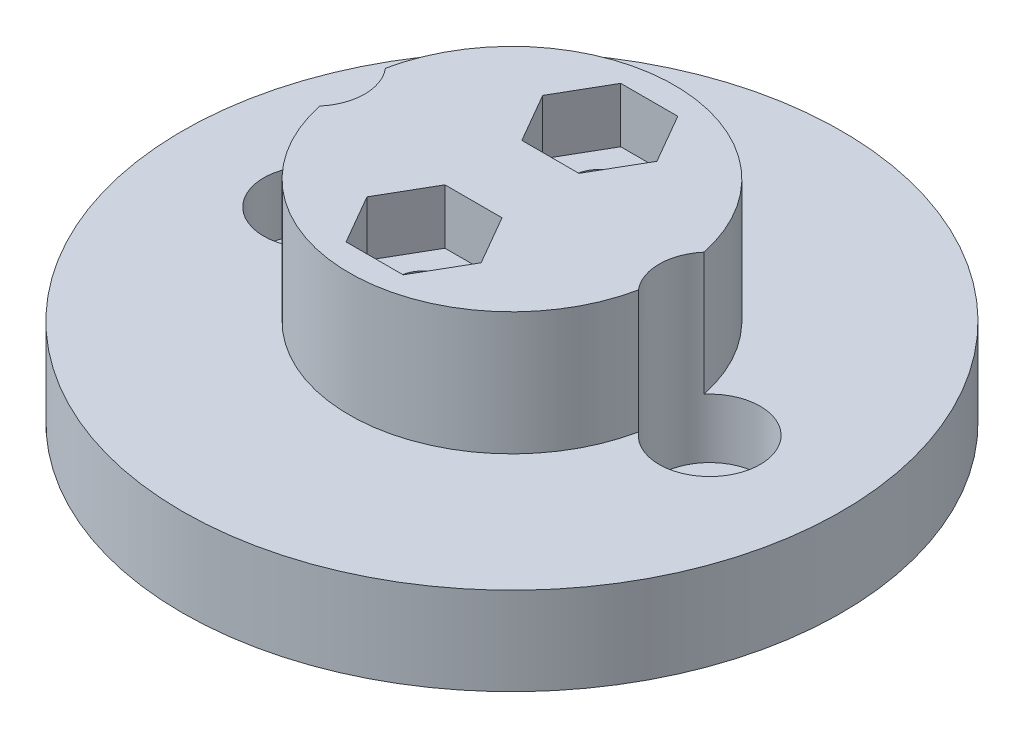
ISO-10303-21;
HEADER;
FILE_DESCRIPTION(('STEP AP214'),'2;1');
FILE_NAME('part.step','',(''),(''),'','','');
FILE_SCHEMA(('AUTOMOTIVE_DESIGN { 1 0 10303 214 1 1 1 1 }'));
ENDSEC;
DATA;
#1=APPLICATION_CONTEXT('core data for automotive mechanical design processes');
#2=APPLICATION_PROTOCOL_DEFINITION('international standard','automotive_design',2000,#1);
#3=PRODUCT_CONTEXT('',#1,'mechanical');
#4=PRODUCT('Part','Part','',(#3));
#5=PRODUCT_RELATED_PRODUCT_CATEGORY('part','',(#4));
#6=PRODUCT_DEFINITION_FORMATION('','',#4);
#7=PRODUCT_DEFINITION_CONTEXT('part definition',#1,'design');
#8=PRODUCT_DEFINITION('design','',#6,#7);
#9=PRODUCT_DEFINITION_SHAPE('','',#8);
#10=(LENGTH_UNIT() NAMED_UNIT(*) SI_UNIT(.MILLI.,.METRE.));
#11=(NAMED_UNIT(*) PLANE_ANGLE_UNIT() SI_UNIT($,.RADIAN.));
#12=(NAMED_UNIT(*) SI_UNIT($,.STERADIAN.) SOLID_ANGLE_UNIT());
#13=UNCERTAINTY_MEASURE_WITH_UNIT(LENGTH_MEASURE(1.E-05),#10,'distance_accuracy_value','');
#14=(GEOMETRIC_REPRESENTATION_CONTEXT(3) GLOBAL_UNCERTAINTY_ASSIGNED_CONTEXT((#13)) GLOBAL_UNIT_ASSIGNED_CONTEXT((#10,
#11,#12)) REPRESENTATION_CONTEXT('',''));
#15=CARTESIAN_POINT('',(0.,0.,0.));
#16=DIRECTION('',(0.,0.,1.));
#17=DIRECTION('',(1.,0.,0.));
#18=AXIS2_PLACEMENT_3D('',#15,#16,#17);
#19=CARTESIAN_POINT('',(0.,12.192,0.));
#20=DIRECTION('',(0.,-1.,0.));
#21=DIRECTION('',(0.,0.,-1.));
#22=AXIS2_PLACEMENT_3D('',#19,#20,#21);
#23=CYLINDRICAL_SURFACE('',#22,9.398);
#24=DIRECTION('',(0.,-1.,0.));
#25=VECTOR('',#24,1.);
#26=CARTESIAN_POINT('',(-9.20538333333333,6.9215,-1.89296637222876));
#27=LINE('',#26,#25);
#28=CARTESIAN_POINT('',(-9.20538333333333,12.192,-1.89296637222876));
#29=VERTEX_POINT('',#28);
#30=CARTESIAN_POINT('',(-9.20538333333333,5.08,-1.89296637222876));
#31=VERTEX_POINT('',#30);
#32=EDGE_CURVE('E281',#29,#31,#27,.T.);
#33=ORIENTED_EDGE('',*,*,#32,.F.);
#34=CARTESIAN_POINT('',(0.,12.192,0.));
#35=DIRECTION('',(0.,1.,0.));
#36=DIRECTION('',(0.,0.,1.));
#37=AXIS2_PLACEMENT_3D('',#34,#35,#36);
#38=CIRCLE('',#37,9.398);
#39=CARTESIAN_POINT('',(9.20538333333333,12.192,-1.89296637222876));
#40=VERTEX_POINT('',#39);
#41=EDGE_CURVE('E285',#40,#29,#38,.T.);
#42=ORIENTED_EDGE('',*,*,#41,.F.);
#43=DIRECTION('',(0.,-1.,0.));
#44=VECTOR('',#43,1.);
#45=CARTESIAN_POINT('',(9.20538333333333,6.9215,-1.89296637222876));
#46=LINE('',#45,#44);
#47=CARTESIAN_POINT('',(9.20538333333333,5.08,-1.89296637222876));
#48=VERTEX_POINT('',#47);
#49=EDGE_CURVE('E264',#48,#40,#46,.F.);
#50=ORIENTED_EDGE('',*,*,#49,.F.);
#51=CARTESIAN_POINT('',(0.,5.08,0.));
#52=DIRECTION('',(0.,1.,0.));
#53=DIRECTION('',(0.,0.,1.));
#54=AXIS2_PLACEMENT_3D('',#51,#52,#53);
#55=CIRCLE('',#54,9.398);
#56=EDGE_CURVE('E11',#48,#31,#55,.T.);
#57=ORIENTED_EDGE('',*,*,#56,.T.);
#58=EDGE_LOOP('',(#33,#42,#50,#57));
#59=FACE_BOUND('',#58,.T.);
#60=ADVANCED_FACE('F33',(#59),#23,.T.);
#61=DIRECTION('',(0.,-1.,0.));
#62=VECTOR('',#61,1.);
#63=CARTESIAN_POINT('',(-9.20538333333333,6.9215,1.89296637222876));
#64=LINE('',#63,#62);
#65=CARTESIAN_POINT('',(-9.20538333333333,5.08,1.89296637222876));
#66=VERTEX_POINT('',#65);
#67=CARTESIAN_POINT('',(-9.20538333333333,12.192,1.89296637222876));
#68=VERTEX_POINT('',#67);
#69=EDGE_CURVE('E276',#66,#68,#64,.F.);
#70=ORIENTED_EDGE('',*,*,#69,.F.);
#71=CARTESIAN_POINT('',(9.20538333333333,5.08,1.89296637222876));
#72=VERTEX_POINT('',#71);
#73=EDGE_CURVE('E42',#66,#72,#55,.T.);
#74=ORIENTED_EDGE('',*,*,#73,.T.);
#75=DIRECTION('',(0.,-1.,0.));
#76=VECTOR('',#75,1.);
#77=CARTESIAN_POINT('',(9.20538333333333,6.9215,1.89296637222876));
#78=LINE('',#77,#76);
#79=CARTESIAN_POINT('',(9.20538333333333,12.192,1.89296637222876));
#80=VERTEX_POINT('',#79);
#81=EDGE_CURVE('E274',#80,#72,#78,.T.);
#82=ORIENTED_EDGE('',*,*,#81,.F.);
#83=EDGE_CURVE('E283',#68,#80,#38,.T.);
#84=ORIENTED_EDGE('',*,*,#83,.F.);
#85=EDGE_LOOP('',(#70,#74,#82,#84));
#86=FACE_BOUND('',#85,.T.);
#87=ADVANCED_FACE('F325',(#86),#23,.T.);
#88=CARTESIAN_POINT('',(0.,5.08,0.));
#89=DIRECTION('',(0.,-1.,0.));
#90=DIRECTION('',(0.,0.,-1.));
#91=AXIS2_PLACEMENT_3D('',#88,#89,#90);
#92=CYLINDRICAL_SURFACE('',#91,19.05);
#93=CARTESIAN_POINT('',(0.,5.08,0.));
#94=DIRECTION('',(0.,1.,0.));
#95=DIRECTION('',(0.,0.,1.));
#96=AXIS2_PLACEMENT_3D('',#93,#94,#95);
#97=CIRCLE('',#96,19.05);
#98=CARTESIAN_POINT('',(0.,5.08,19.05));
#99=VERTEX_POINT('',#98);
#100=EDGE_CURVE('E288',#99,#99,#97,.T.);
#101=ORIENTED_EDGE('',*,*,#100,.F.);
#102=EDGE_LOOP('',(#101));
#103=FACE_BOUND('',#102,.T.);
#104=CARTESIAN_POINT('',(0.,0.,0.));
#105=DIRECTION('',(0.,1.,0.));
#106=DIRECTION('',(0.,0.,1.));
#107=AXIS2_PLACEMENT_3D('',#104,#105,#106);
#108=CIRCLE('',#107,19.05);
#109=CARTESIAN_POINT('',(0.,0.,19.05));
#110=VERTEX_POINT('',#109);
#111=EDGE_CURVE('E291',#110,#110,#108,.T.);
#112=ORIENTED_EDGE('',*,*,#111,.T.);
#113=EDGE_LOOP('',(#112));
#114=FACE_BOUND('',#113,.T.);
#115=ADVANCED_FACE('F35',(#103,#114),#92,.T.);
#116=CARTESIAN_POINT('',(0.,5.08,0.));
#117=DIRECTION('',(0.,1.,0.));
#118=DIRECTION('',(0.,0.,1.));
#119=AXIS2_PLACEMENT_3D('',#116,#117,#118);
#120=PLANE('',#119);
#121=ORIENTED_EDGE('',*,*,#73,.F.);
#122=CARTESIAN_POINT('',(-11.43,5.08,0.));
#123=DIRECTION('',(0.,1.,0.));
#124=DIRECTION('',(0.,0.,1.));
#125=AXIS2_PLACEMENT_3D('',#122,#123,#124);
#126=CIRCLE('',#125,2.921);
#127=EDGE_CURVE('E278',#66,#31,#126,.F.);
#128=ORIENTED_EDGE('',*,*,#127,.T.);
#129=ORIENTED_EDGE('',*,*,#56,.F.);
#130=CARTESIAN_POINT('',(11.43,5.08,0.));
#131=DIRECTION('',(0.,1.,0.));
#132=DIRECTION('',(0.,0.,1.));
#133=AXIS2_PLACEMENT_3D('',#130,#131,#132);
#134=CIRCLE('',#133,2.921);
#135=EDGE_CURVE('E271',#48,#72,#134,.F.);
#136=ORIENTED_EDGE('',*,*,#135,.T.);
#137=EDGE_LOOP('',(#121,#128,#129,#136));
#138=FACE_BOUND('',#137,.T.);
#139=ORIENTED_EDGE('',*,*,#100,.T.);
#140=EDGE_LOOP('',(#139));
#141=FACE_BOUND('',#140,.T.);
#142=ADVANCED_FACE('F337',(#138,#141),#120,.T.);
#143=CARTESIAN_POINT('',(0.,0.,0.));
#144=DIRECTION('',(0.,1.,0.));
#145=DIRECTION('',(0.,0.,1.));
#146=AXIS2_PLACEMENT_3D('',#143,#144,#145);
#147=PLANE('',#146);
#148=CARTESIAN_POINT('',(-11.43,0.,0.));
#149=DIRECTION('',(0.,1.,0.));
#150=DIRECTION('',(0.,0.,1.));
#151=AXIS2_PLACEMENT_3D('',#148,#149,#150);
#152=CIRCLE('',#151,1.4605);
#153=CARTESIAN_POINT('',(-11.43,0.,1.4605));
#154=VERTEX_POINT('',#153);
#155=EDGE_CURVE('E252',#154,#154,#152,.T.);
#156=ORIENTED_EDGE('',*,*,#155,.T.);
#157=EDGE_LOOP('',(#156));
#158=FACE_BOUND('',#157,.T.);
#159=CARTESIAN_POINT('',(11.43,0.,0.));
#160=DIRECTION('',(0.,1.,0.));
#161=DIRECTION('',(0.,0.,1.));
#162=AXIS2_PLACEMENT_3D('',#159,#160,#161);
#163=CIRCLE('',#162,1.73706235952143);
#164=CARTESIAN_POINT('',(11.43,0.,1.73706235952143));
#165=VERTEX_POINT('',#164);
#166=EDGE_CURVE('E199',#165,#165,#163,.T.);
#167=ORIENTED_EDGE('',*,*,#166,.T.);
#168=EDGE_LOOP('',(#167));
#169=FACE_BOUND('',#168,.T.);
#170=ORIENTED_EDGE('',*,*,#111,.F.);
#171=EDGE_LOOP('',(#170));
#172=FACE_BOUND('',#171,.T.);
#173=ADVANCED_FACE('F339',(#158,#169,#172),#147,.F.);
#174=CARTESIAN_POINT('',(0.,12.192,0.));
#175=DIRECTION('',(0.,1.,0.));
#176=DIRECTION('',(0.,0.,1.));
#177=AXIS2_PLACEMENT_3D('',#174,#175,#176);
#178=PLANE('',#177);
#179=DIRECTION('',(0.5,0.,-0.866025403784439));
#180=VECTOR('',#179,1.);
#181=CARTESIAN_POINT('',(1.64977839420936,12.192,-2.2225));
#182=LINE('',#181,#180);
#183=CARTESIAN_POINT('',(1.64977839420936,12.192,-2.2225));
#184=VERTEX_POINT('',#183);
#185=CARTESIAN_POINT('',(3.29955678841871,12.192,-5.08));
#186=VERTEX_POINT('',#185);
#187=EDGE_CURVE('E50',#184,#186,#182,.T.);
#188=ORIENTED_EDGE('',*,*,#187,.F.);
#189=DIRECTION('',(1.,0.,0.));
#190=VECTOR('',#189,1.);
#191=CARTESIAN_POINT('',(-1.64977839420936,12.192,-2.2225));
#192=LINE('',#191,#190);
#193=CARTESIAN_POINT('',(-1.64977839420936,12.192,-2.2225));
#194=VERTEX_POINT('',#193);
#195=EDGE_CURVE('E169',#194,#184,#192,.T.);
#196=ORIENTED_EDGE('',*,*,#195,.F.);
#197=DIRECTION('',(0.5,0.,0.866025403784439));
#198=VECTOR('',#197,1.);
#199=CARTESIAN_POINT('',(-3.29955678841871,12.192,-5.08));
#200=LINE('',#199,#198);
#201=CARTESIAN_POINT('',(-3.29955678841871,12.192,-5.08));
#202=VERTEX_POINT('',#201);
#203=EDGE_CURVE('E172',#202,#194,#200,.T.);
#204=ORIENTED_EDGE('',*,*,#203,.F.);
#205=DIRECTION('',(-0.5,0.,0.866025403784439));
#206=VECTOR('',#205,1.);
#207=CARTESIAN_POINT('',(-1.64977839420936,12.192,-7.9375));
#208=LINE('',#207,#206);
#209=CARTESIAN_POINT('',(-1.64977839420936,12.192,-7.9375));
#210=VERTEX_POINT('',#209);
#211=EDGE_CURVE('E192',#210,#202,#208,.T.);
#212=ORIENTED_EDGE('',*,*,#211,.F.);
#213=DIRECTION('',(-1.,0.,0.));
#214=VECTOR('',#213,1.);
#215=CARTESIAN_POINT('',(1.64977839420935,12.192,-7.9375));
#216=LINE('',#215,#214);
#217=CARTESIAN_POINT('',(1.64977839420935,12.192,-7.9375));
#218=VERTEX_POINT('',#217);
#219=EDGE_CURVE('E189',#218,#210,#216,.T.);
#220=ORIENTED_EDGE('',*,*,#219,.F.);
#221=DIRECTION('',(-0.5,0.,-0.866025403784439));
#222=VECTOR('',#221,1.);
#223=CARTESIAN_POINT('',(3.29955678841871,12.192,-5.08));
#224=LINE('',#223,#222);
#225=EDGE_CURVE('E186',#186,#218,#224,.T.);
#226=ORIENTED_EDGE('',*,*,#225,.F.);
#227=EDGE_LOOP('',(#188,#196,#204,#212,#220,#226));
#228=FACE_BOUND('',#227,.T.);
#229=DIRECTION('',(0.5,0.,-0.866025403784439));
#230=VECTOR('',#229,1.);
#231=CARTESIAN_POINT('',(1.64977839420935,12.192,7.9375));
#232=LINE('',#231,#230);
#233=CARTESIAN_POINT('',(1.64977839420935,12.192,7.9375));
#234=VERTEX_POINT('',#233);
#235=CARTESIAN_POINT('',(3.29955678841871,12.192,5.08));
#236=VERTEX_POINT('',#235);
#237=EDGE_CURVE('E58',#234,#236,#232,.T.);
#238=ORIENTED_EDGE('',*,*,#237,.F.);
#239=DIRECTION('',(1.,0.,0.));
#240=VECTOR('',#239,1.);
#241=CARTESIAN_POINT('',(-1.64977839420936,12.192,7.9375));
#242=LINE('',#241,#240);
#243=CARTESIAN_POINT('',(-1.64977839420936,12.192,7.9375));
#244=VERTEX_POINT('',#243);
#245=EDGE_CURVE('E211',#244,#234,#242,.T.);
#246=ORIENTED_EDGE('',*,*,#245,.F.);
#247=DIRECTION('',(0.5,0.,0.866025403784438));
#248=VECTOR('',#247,1.);
#249=CARTESIAN_POINT('',(-3.29955678841871,12.192,5.08));
#250=LINE('',#249,#248);
#251=CARTESIAN_POINT('',(-3.29955678841871,12.192,5.08));
#252=VERTEX_POINT('',#251);
#253=EDGE_CURVE('E237',#252,#244,#250,.T.);
#254=ORIENTED_EDGE('',*,*,#253,.F.);
#255=DIRECTION('',(-0.5,0.,0.866025403784439));
#256=VECTOR('',#255,1.);
#257=CARTESIAN_POINT('',(-1.64977839420936,12.192,2.2225));
#258=LINE('',#257,#256);
#259=CARTESIAN_POINT('',(-1.64977839420936,12.192,2.2225));
#260=VERTEX_POINT('',#259);
#261=EDGE_CURVE('E234',#260,#252,#258,.T.);
#262=ORIENTED_EDGE('',*,*,#261,.F.);
#263=DIRECTION('',(-1.,0.,0.));
#264=VECTOR('',#263,1.);
#265=CARTESIAN_POINT('',(1.64977839420935,12.192,2.2225));
#266=LINE('',#265,#264);
#267=CARTESIAN_POINT('',(1.64977839420935,12.192,2.2225));
#268=VERTEX_POINT('',#267);
#269=EDGE_CURVE('E231',#268,#260,#266,.T.);
#270=ORIENTED_EDGE('',*,*,#269,.F.);
#271=DIRECTION('',(-0.5,0.,-0.866025403784439));
#272=VECTOR('',#271,1.);
#273=CARTESIAN_POINT('',(3.29955678841871,12.192,5.08));
#274=LINE('',#273,#272);
#275=EDGE_CURVE('E228',#236,#268,#274,.T.);
#276=ORIENTED_EDGE('',*,*,#275,.F.);
#277=EDGE_LOOP('',(#238,#246,#254,#262,#270,#276));
#278=FACE_BOUND('',#277,.T.);
#279=ORIENTED_EDGE('',*,*,#41,.T.);
#280=CARTESIAN_POINT('',(-11.43,12.192,0.));
#281=DIRECTION('',(0.,1.,0.));
#282=DIRECTION('',(0.,0.,1.));
#283=AXIS2_PLACEMENT_3D('',#280,#281,#282);
#284=CIRCLE('',#283,2.921);
#285=EDGE_CURVE('E261',#68,#29,#284,.T.);
#286=ORIENTED_EDGE('',*,*,#285,.F.);
#287=ORIENTED_EDGE('',*,*,#83,.T.);
#288=CARTESIAN_POINT('',(11.43,12.192,0.));
#289=DIRECTION('',(0.,1.,0.));
#290=DIRECTION('',(0.,0.,1.));
#291=AXIS2_PLACEMENT_3D('',#288,#289,#290);
#292=CIRCLE('',#291,2.921);
#293=EDGE_CURVE('E262',#40,#80,#292,.T.);
#294=ORIENTED_EDGE('',*,*,#293,.F.);
#295=EDGE_LOOP('',(#279,#286,#287,#294));
#296=FACE_BOUND('',#295,.T.);
#297=ADVANCED_FACE('F335',(#228,#278,#296),#178,.T.);
#298=CARTESIAN_POINT('',(11.43,12.192,0.));
#299=DIRECTION('',(0.,-1.,0.));
#300=DIRECTION('',(0.,0.,-1.));
#301=AXIS2_PLACEMENT_3D('',#298,#299,#300);
#302=CYLINDRICAL_SURFACE('',#301,2.921);
#303=CARTESIAN_POINT('',(11.43,1.651,0.));
#304=DIRECTION('',(0.,1.,0.));
#305=DIRECTION('',(0.,0.,1.));
#306=AXIS2_PLACEMENT_3D('',#303,#304,#305);
#307=CIRCLE('',#306,2.921);
#308=CARTESIAN_POINT('',(11.43,1.651,2.921));
#309=VERTEX_POINT('',#308);
#310=EDGE_CURVE('E265',#309,#309,#307,.T.);
#311=ORIENTED_EDGE('',*,*,#310,.F.);
#312=EDGE_LOOP('',(#311));
#313=FACE_BOUND('',#312,.T.);
#314=ORIENTED_EDGE('',*,*,#81,.T.);
#315=ORIENTED_EDGE('',*,*,#135,.F.);
#316=ORIENTED_EDGE('',*,*,#49,.T.);
#317=ORIENTED_EDGE('',*,*,#293,.T.);
#318=EDGE_LOOP('',(#314,#315,#316,#317));
#319=FACE_BOUND('',#318,.T.);
#320=ADVANCED_FACE('F346',(#313,#319),#302,.F.);
#321=CARTESIAN_POINT('',(11.43,1.651,0.));
#322=DIRECTION('',(0.,1.,0.));
#323=DIRECTION('',(0.,0.,1.));
#324=AXIS2_PLACEMENT_3D('',#321,#322,#323);
#325=PLANE('',#324);
#326=CARTESIAN_POINT('',(11.43,1.651,0.));
#327=DIRECTION('',(0.,1.,0.));
#328=DIRECTION('',(0.,0.,1.));
#329=AXIS2_PLACEMENT_3D('',#326,#327,#328);
#330=CIRCLE('',#329,1.73706235952143);
#331=CARTESIAN_POINT('',(11.43,1.651,1.73706235952143));
#332=VERTEX_POINT('',#331);
#333=EDGE_CURVE('E268',#332,#332,#330,.T.);
#334=ORIENTED_EDGE('',*,*,#333,.F.);
#335=EDGE_LOOP('',(#334));
#336=FACE_BOUND('',#335,.T.);
#337=ORIENTED_EDGE('',*,*,#310,.T.);
#338=EDGE_LOOP('',(#337));
#339=FACE_BOUND('',#338,.T.);
#340=ADVANCED_FACE('F378',(#336,#339),#325,.T.);
#341=CARTESIAN_POINT('',(-11.43,12.192,0.));
#342=DIRECTION('',(0.,-1.,0.));
#343=DIRECTION('',(0.,0.,-1.));
#344=AXIS2_PLACEMENT_3D('',#341,#342,#343);
#345=CYLINDRICAL_SURFACE('',#344,2.921);
#346=CARTESIAN_POINT('',(-11.43,1.651,0.));
#347=DIRECTION('',(0.,1.,0.));
#348=DIRECTION('',(0.,0.,1.));
#349=AXIS2_PLACEMENT_3D('',#346,#347,#348);
#350=CIRCLE('',#349,2.921);
#351=CARTESIAN_POINT('',(-11.43,1.651,2.921));
#352=VERTEX_POINT('',#351);
#353=EDGE_CURVE('E258',#352,#352,#350,.T.);
#354=ORIENTED_EDGE('',*,*,#353,.F.);
#355=EDGE_LOOP('',(#354));
#356=FACE_BOUND('',#355,.T.);
#357=ORIENTED_EDGE('',*,*,#32,.T.);
#358=ORIENTED_EDGE('',*,*,#127,.F.);
#359=ORIENTED_EDGE('',*,*,#69,.T.);
#360=ORIENTED_EDGE('',*,*,#285,.T.);
#361=EDGE_LOOP('',(#357,#358,#359,#360));
#362=FACE_BOUND('',#361,.T.);
#363=ADVANCED_FACE('F386',(#356,#362),#345,.F.);
#364=CARTESIAN_POINT('',(-11.43,1.651,0.));
#365=DIRECTION('',(0.,1.,0.));
#366=DIRECTION('',(0.,0.,1.));
#367=AXIS2_PLACEMENT_3D('',#364,#365,#366);
#368=PLANE('',#367);
#369=CARTESIAN_POINT('',(-11.43,1.651,0.));
#370=DIRECTION('',(0.,1.,0.));
#371=DIRECTION('',(0.,0.,1.));
#372=AXIS2_PLACEMENT_3D('',#369,#370,#371);
#373=CIRCLE('',#372,1.4605);
#374=CARTESIAN_POINT('',(-11.43,1.651,1.4605));
#375=VERTEX_POINT('',#374);
#376=EDGE_CURVE('E255',#375,#375,#373,.T.);
#377=ORIENTED_EDGE('',*,*,#376,.F.);
#378=EDGE_LOOP('',(#377));
#379=FACE_BOUND('',#378,.T.);
#380=ORIENTED_EDGE('',*,*,#353,.T.);
#381=EDGE_LOOP('',(#380));
#382=FACE_BOUND('',#381,.T.);
#383=ADVANCED_FACE('F390',(#379,#382),#368,.T.);
#384=CARTESIAN_POINT('',(-11.43,0.,0.));
#385=DIRECTION('',(0.,1.,0.));
#386=DIRECTION('',(0.,0.,1.));
#387=AXIS2_PLACEMENT_3D('',#384,#385,#386);
#388=CYLINDRICAL_SURFACE('',#387,1.4605);
#389=ORIENTED_EDGE('',*,*,#376,.T.);
#390=EDGE_LOOP('',(#389));
#391=FACE_BOUND('',#390,.T.);
#392=ORIENTED_EDGE('',*,*,#155,.F.);
#393=EDGE_LOOP('',(#392));
#394=FACE_BOUND('',#393,.T.);
#395=ADVANCED_FACE('F412',(#391,#394),#388,.F.);
#396=CARTESIAN_POINT('',(11.43,0.,0.));
#397=DIRECTION('',(0.,1.,0.));
#398=DIRECTION('',(0.,0.,1.));
#399=AXIS2_PLACEMENT_3D('',#396,#397,#398);
#400=CYLINDRICAL_SURFACE('',#399,1.73706235952143);
#401=ORIENTED_EDGE('',*,*,#333,.T.);
#402=EDGE_LOOP('',(#401));
#403=FACE_BOUND('',#402,.T.);
#404=ORIENTED_EDGE('',*,*,#166,.F.);
#405=EDGE_LOOP('',(#404));
#406=FACE_BOUND('',#405,.T.);
#407=ADVANCED_FACE('F422',(#403,#406),#400,.F.);
#408=CARTESIAN_POINT('',(1.64977839420935,9.017,7.9375));
#409=DIRECTION('',(0.866025403784439,0.,0.5));
#410=DIRECTION('',(0.5,0.,-0.866025403784439));
#411=AXIS2_PLACEMENT_3D('',#408,#409,#410);
#412=PLANE('',#411);
#413=ORIENTED_EDGE('',*,*,#237,.T.);
#414=DIRECTION('',(0.,1.,0.));
#415=VECTOR('',#414,1.);
#416=CARTESIAN_POINT('',(3.29955678841871,9.017,5.08));
#417=LINE('',#416,#415);
#418=CARTESIAN_POINT('',(3.29955678841871,9.017,5.08));
#419=VERTEX_POINT('',#418);
#420=EDGE_CURVE('E226',#419,#236,#417,.T.);
#421=ORIENTED_EDGE('',*,*,#420,.F.);
#422=DIRECTION('',(0.5,0.,-0.866025403784439));
#423=VECTOR('',#422,1.);
#424=CARTESIAN_POINT('',(1.64977839420935,9.017,7.9375));
#425=LINE('',#424,#423);
#426=CARTESIAN_POINT('',(1.64977839420935,9.017,7.9375));
#427=VERTEX_POINT('',#426);
#428=EDGE_CURVE('E207',#427,#419,#425,.T.);
#429=ORIENTED_EDGE('',*,*,#428,.F.);
#430=DIRECTION('',(0.,1.,0.));
#431=VECTOR('',#430,1.);
#432=CARTESIAN_POINT('',(1.64977839420935,9.017,7.9375));
#433=LINE('',#432,#431);
#434=EDGE_CURVE('E187',#427,#234,#433,.T.);
#435=ORIENTED_EDGE('',*,*,#434,.T.);
#436=EDGE_LOOP('',(#413,#421,#429,#435));
#437=FACE_BOUND('',#436,.T.);
#438=ADVANCED_FACE('F432',(#437),#412,.F.);
#439=CARTESIAN_POINT('',(-1.64977839420936,9.017,7.9375));
#440=DIRECTION('',(0.,0.,1.));
#441=DIRECTION('',(1.,0.,0.));
#442=AXIS2_PLACEMENT_3D('',#439,#440,#441);
#443=PLANE('',#442);
#444=ORIENTED_EDGE('',*,*,#245,.T.);
#445=ORIENTED_EDGE('',*,*,#434,.F.);
#446=DIRECTION('',(1.,0.,0.));
#447=VECTOR('',#446,1.);
#448=CARTESIAN_POINT('',(-1.64977839420936,9.017,7.9375));
#449=LINE('',#448,#447);
#450=CARTESIAN_POINT('',(-1.64977839420936,9.017,7.9375));
#451=VERTEX_POINT('',#450);
#452=EDGE_CURVE('E223',#451,#427,#449,.T.);
#453=ORIENTED_EDGE('',*,*,#452,.F.);
#454=DIRECTION('',(0.,1.,0.));
#455=VECTOR('',#454,1.);
#456=CARTESIAN_POINT('',(-1.64977839420936,9.017,7.9375));
#457=LINE('',#456,#455);
#458=EDGE_CURVE('E243',#451,#244,#457,.T.);
#459=ORIENTED_EDGE('',*,*,#458,.T.);
#460=EDGE_LOOP('',(#444,#445,#453,#459));
#461=FACE_BOUND('',#460,.T.);
#462=ADVANCED_FACE('F447',(#461),#443,.F.);
#463=CARTESIAN_POINT('',(-3.29955678841871,9.017,5.08));
#464=DIRECTION('',(-0.866025403784438,0.,0.5));
#465=DIRECTION('',(0.5,0.,0.866025403784439));
#466=AXIS2_PLACEMENT_3D('',#463,#464,#465);
#467=PLANE('',#466);
#468=ORIENTED_EDGE('',*,*,#253,.T.);
#469=ORIENTED_EDGE('',*,*,#458,.F.);
#470=DIRECTION('',(0.5,0.,0.866025403784438));
#471=VECTOR('',#470,1.);
#472=CARTESIAN_POINT('',(-3.29955678841871,9.017,5.08));
#473=LINE('',#472,#471);
#474=CARTESIAN_POINT('',(-3.29955678841871,9.017,5.08));
#475=VERTEX_POINT('',#474);
#476=EDGE_CURVE('E220',#475,#451,#473,.T.);
#477=ORIENTED_EDGE('',*,*,#476,.F.);
#478=DIRECTION('',(0.,1.,0.));
#479=VECTOR('',#478,1.);
#480=CARTESIAN_POINT('',(-3.29955678841871,9.017,5.08));
#481=LINE('',#480,#479);
#482=EDGE_CURVE('E245',#475,#252,#481,.T.);
#483=ORIENTED_EDGE('',*,*,#482,.T.);
#484=EDGE_LOOP('',(#468,#469,#477,#483));
#485=FACE_BOUND('',#484,.T.);
#486=ADVANCED_FACE('F456',(#485),#467,.F.);
#487=CARTESIAN_POINT('',(-1.64977839420936,9.017,2.2225));
#488=DIRECTION('',(-0.866025403784439,0.,-0.5));
#489=DIRECTION('',(-0.5,0.,0.866025403784439));
#490=AXIS2_PLACEMENT_3D('',#487,#488,#489);
#491=PLANE('',#490);
#492=ORIENTED_EDGE('',*,*,#261,.T.);
#493=ORIENTED_EDGE('',*,*,#482,.F.);
#494=DIRECTION('',(-0.5,0.,0.866025403784439));
#495=VECTOR('',#494,1.);
#496=CARTESIAN_POINT('',(-1.64977839420936,9.017,2.2225));
#497=LINE('',#496,#495);
#498=CARTESIAN_POINT('',(-1.64977839420936,9.017,2.2225));
#499=VERTEX_POINT('',#498);
#500=EDGE_CURVE('E217',#499,#475,#497,.T.);
#501=ORIENTED_EDGE('',*,*,#500,.F.);
#502=DIRECTION('',(0.,1.,0.));
#503=VECTOR('',#502,1.);
#504=CARTESIAN_POINT('',(-1.64977839420936,9.017,2.2225));
#505=LINE('',#504,#503);
#506=EDGE_CURVE('E247',#499,#260,#505,.T.);
#507=ORIENTED_EDGE('',*,*,#506,.T.);
#508=EDGE_LOOP('',(#492,#493,#501,#507));
#509=FACE_BOUND('',#508,.T.);
#510=ADVANCED_FACE('F466',(#509),#491,.F.);
#511=CARTESIAN_POINT('',(1.64977839420935,9.017,2.2225));
#512=DIRECTION('',(0.,0.,-1.));
#513=DIRECTION('',(-1.,0.,0.));
#514=AXIS2_PLACEMENT_3D('',#511,#512,#513);
#515=PLANE('',#514);
#516=ORIENTED_EDGE('',*,*,#269,.T.);
#517=ORIENTED_EDGE('',*,*,#506,.F.);
#518=DIRECTION('',(-1.,0.,0.));
#519=VECTOR('',#518,1.);
#520=CARTESIAN_POINT('',(1.64977839420935,9.017,2.2225));
#521=LINE('',#520,#519);
#522=CARTESIAN_POINT('',(1.64977839420935,9.017,2.2225));
#523=VERTEX_POINT('',#522);
#524=EDGE_CURVE('E214',#523,#499,#521,.T.);
#525=ORIENTED_EDGE('',*,*,#524,.F.);
#526=DIRECTION('',(0.,1.,0.));
#527=VECTOR('',#526,1.);
#528=CARTESIAN_POINT('',(1.64977839420935,9.017,2.2225));
#529=LINE('',#528,#527);
#530=EDGE_CURVE('E249',#523,#268,#529,.T.);
#531=ORIENTED_EDGE('',*,*,#530,.T.);
#532=EDGE_LOOP('',(#516,#517,#525,#531));
#533=FACE_BOUND('',#532,.T.);
#534=ADVANCED_FACE('F476',(#533),#515,.F.);
#535=CARTESIAN_POINT('',(3.29955678841871,9.017,5.08));
#536=DIRECTION('',(0.866025403784439,0.,-0.5));
#537=DIRECTION('',(-0.5,0.,-0.866025403784439));
#538=AXIS2_PLACEMENT_3D('',#535,#536,#537);
#539=PLANE('',#538);
#540=ORIENTED_EDGE('',*,*,#275,.T.);
#541=ORIENTED_EDGE('',*,*,#530,.F.);
#542=DIRECTION('',(-0.5,0.,-0.866025403784439));
#543=VECTOR('',#542,1.);
#544=CARTESIAN_POINT('',(3.29955678841871,9.017,5.08));
#545=LINE('',#544,#543);
#546=EDGE_CURVE('E210',#419,#523,#545,.T.);
#547=ORIENTED_EDGE('',*,*,#546,.F.);
#548=ORIENTED_EDGE('',*,*,#420,.T.);
#549=EDGE_LOOP('',(#540,#541,#547,#548));
#550=FACE_BOUND('',#549,.T.);
#551=ADVANCED_FACE('F486',(#550),#539,.F.);
#552=CARTESIAN_POINT('',(0.,9.017,0.));
#553=DIRECTION('',(0.,1.,0.));
#554=DIRECTION('',(0.,0.,1.));
#555=AXIS2_PLACEMENT_3D('',#552,#553,#554);
#556=PLANE('',#555);
#557=CARTESIAN_POINT('',(0.,9.017,5.08));
#558=DIRECTION('',(0.,1.,0.));
#559=DIRECTION('',(0.,0.,1.));
#560=AXIS2_PLACEMENT_3D('',#557,#558,#559);
#561=CIRCLE('',#560,1.5875);
#562=CARTESIAN_POINT('',(0.,9.017,6.6675));
#563=VERTEX_POINT('',#562);
#564=EDGE_CURVE('E37',#563,#563,#561,.T.);
#565=ORIENTED_EDGE('',*,*,#564,.F.);
#566=EDGE_LOOP('',(#565));
#567=FACE_BOUND('',#566,.T.);
#568=ORIENTED_EDGE('',*,*,#428,.T.);
#569=ORIENTED_EDGE('',*,*,#546,.T.);
#570=ORIENTED_EDGE('',*,*,#524,.T.);
#571=ORIENTED_EDGE('',*,*,#500,.T.);
#572=ORIENTED_EDGE('',*,*,#476,.T.);
#573=ORIENTED_EDGE('',*,*,#452,.T.);
#574=EDGE_LOOP('',(#568,#569,#570,#571,#572,#573));
#575=FACE_BOUND('',#574,.T.);
#576=ADVANCED_FACE('F496',(#567,#575),#556,.T.);
#577=CARTESIAN_POINT('',(1.64977839420936,9.017,-2.2225));
#578=DIRECTION('',(0.866025403784439,0.,0.5));
#579=DIRECTION('',(0.5,0.,-0.866025403784439));
#580=AXIS2_PLACEMENT_3D('',#577,#578,#579);
#581=PLANE('',#580);
#582=ORIENTED_EDGE('',*,*,#187,.T.);
#583=DIRECTION('',(0.,1.,0.));
#584=VECTOR('',#583,1.);
#585=CARTESIAN_POINT('',(3.29955678841871,9.017,-5.08));
#586=LINE('',#585,#584);
#587=CARTESIAN_POINT('',(3.29955678841871,9.017,-5.08));
#588=VERTEX_POINT('',#587);
#589=EDGE_CURVE('E146',#588,#186,#586,.T.);
#590=ORIENTED_EDGE('',*,*,#589,.F.);
#591=DIRECTION('',(0.5,0.,-0.866025403784439));
#592=VECTOR('',#591,1.);
#593=CARTESIAN_POINT('',(1.64977839420936,9.017,-2.2225));
#594=LINE('',#593,#592);
#595=CARTESIAN_POINT('',(1.64977839420936,9.017,-2.2225));
#596=VERTEX_POINT('',#595);
#597=EDGE_CURVE('E150',#596,#588,#594,.T.);
#598=ORIENTED_EDGE('',*,*,#597,.F.);
#599=DIRECTION('',(0.,1.,0.));
#600=VECTOR('',#599,1.);
#601=CARTESIAN_POINT('',(1.64977839420936,9.017,-2.2225));
#602=LINE('',#601,#600);
#603=EDGE_CURVE('E197',#596,#184,#602,.T.);
#604=ORIENTED_EDGE('',*,*,#603,.T.);
#605=EDGE_LOOP('',(#582,#590,#598,#604));
#606=FACE_BOUND('',#605,.T.);
#607=ADVANCED_FACE('F148',(#606),#581,.F.);
#608=CARTESIAN_POINT('',(-1.64977839420936,9.017,-2.2225));
#609=DIRECTION('',(0.,0.,1.));
#610=DIRECTION('',(1.,0.,0.));
#611=AXIS2_PLACEMENT_3D('',#608,#609,#610);
#612=PLANE('',#611);
#613=ORIENTED_EDGE('',*,*,#195,.T.);
#614=ORIENTED_EDGE('',*,*,#603,.F.);
#615=DIRECTION('',(1.,0.,0.));
#616=VECTOR('',#615,1.);
#617=CARTESIAN_POINT('',(-1.64977839420936,9.017,-2.2225));
#618=LINE('',#617,#616);
#619=CARTESIAN_POINT('',(-1.64977839420936,9.017,-2.2225));
#620=VERTEX_POINT('',#619);
#621=EDGE_CURVE('E156',#620,#596,#618,.T.);
#622=ORIENTED_EDGE('',*,*,#621,.F.);
#623=DIRECTION('',(0.,1.,0.));
#624=VECTOR('',#623,1.);
#625=CARTESIAN_POINT('',(-1.64977839420936,9.017,-2.2225));
#626=LINE('',#625,#624);
#627=EDGE_CURVE('E200',#620,#194,#626,.T.);
#628=ORIENTED_EDGE('',*,*,#627,.T.);
#629=EDGE_LOOP('',(#613,#614,#622,#628));
#630=FACE_BOUND('',#629,.T.);
#631=ADVANCED_FACE('F508',(#630),#612,.F.);
#632=CARTESIAN_POINT('',(-3.29955678841871,9.017,-5.08));
#633=DIRECTION('',(-0.866025403784439,0.,0.5));
#634=DIRECTION('',(0.5,0.,0.866025403784439));
#635=AXIS2_PLACEMENT_3D('',#632,#633,#634);
#636=PLANE('',#635);
#637=ORIENTED_EDGE('',*,*,#203,.T.);
#638=ORIENTED_EDGE('',*,*,#627,.F.);
#639=DIRECTION('',(0.5,0.,0.866025403784439));
#640=VECTOR('',#639,1.);
#641=CARTESIAN_POINT('',(-3.29955678841871,9.017,-5.08));
#642=LINE('',#641,#640);
#643=CARTESIAN_POINT('',(-3.29955678841871,9.017,-5.08));
#644=VERTEX_POINT('',#643);
#645=EDGE_CURVE('E182',#644,#620,#642,.T.);
#646=ORIENTED_EDGE('',*,*,#645,.F.);
#647=DIRECTION('',(0.,1.,0.));
#648=VECTOR('',#647,1.);
#649=CARTESIAN_POINT('',(-3.29955678841871,9.017,-5.08));
#650=LINE('',#649,#648);
#651=EDGE_CURVE('E202',#644,#202,#650,.T.);
#652=ORIENTED_EDGE('',*,*,#651,.T.);
#653=EDGE_LOOP('',(#637,#638,#646,#652));
#654=FACE_BOUND('',#653,.T.);
#655=ADVANCED_FACE('F517',(#654),#636,.F.);
#656=CARTESIAN_POINT('',(-1.64977839420936,9.017,-7.9375));
#657=DIRECTION('',(-0.866025403784439,0.,-0.5));
#658=DIRECTION('',(-0.5,0.,0.866025403784439));
#659=AXIS2_PLACEMENT_3D('',#656,#657,#658);
#660=PLANE('',#659);
#661=ORIENTED_EDGE('',*,*,#211,.T.);
#662=ORIENTED_EDGE('',*,*,#651,.F.);
#663=DIRECTION('',(-0.5,0.,0.866025403784439));
#664=VECTOR('',#663,1.);
#665=CARTESIAN_POINT('',(-1.64977839420936,9.017,-7.9375));
#666=LINE('',#665,#664);
#667=CARTESIAN_POINT('',(-1.64977839420936,9.017,-7.9375));
#668=VERTEX_POINT('',#667);
#669=EDGE_CURVE('E179',#668,#644,#666,.T.);
#670=ORIENTED_EDGE('',*,*,#669,.F.);
#671=DIRECTION('',(0.,1.,0.));
#672=VECTOR('',#671,1.);
#673=CARTESIAN_POINT('',(-1.64977839420936,9.017,-7.9375));
#674=LINE('',#673,#672);
#675=EDGE_CURVE('E204',#668,#210,#674,.T.);
#676=ORIENTED_EDGE('',*,*,#675,.T.);
#677=EDGE_LOOP('',(#661,#662,#670,#676));
#678=FACE_BOUND('',#677,.T.);
#679=ADVANCED_FACE('F527',(#678),#660,.F.);
#680=CARTESIAN_POINT('',(1.64977839420935,9.017,-7.9375));
#681=DIRECTION('',(0.,0.,-1.));
#682=DIRECTION('',(-1.,0.,0.));
#683=AXIS2_PLACEMENT_3D('',#680,#681,#682);
#684=PLANE('',#683);
#685=ORIENTED_EDGE('',*,*,#219,.T.);
#686=ORIENTED_EDGE('',*,*,#675,.F.);
#687=DIRECTION('',(-1.,0.,0.));
#688=VECTOR('',#687,1.);
#689=CARTESIAN_POINT('',(1.64977839420935,9.017,-7.9375));
#690=LINE('',#689,#688);
#691=CARTESIAN_POINT('',(1.64977839420935,9.017,-7.9375));
#692=VERTEX_POINT('',#691);
#693=EDGE_CURVE('E164',#692,#668,#690,.T.);
#694=ORIENTED_EDGE('',*,*,#693,.F.);
#695=DIRECTION('',(0.,1.,0.));
#696=VECTOR('',#695,1.);
#697=CARTESIAN_POINT('',(1.64977839420935,9.017,-7.9375));
#698=LINE('',#697,#696);
#699=EDGE_CURVE('E155',#692,#218,#698,.T.);
#700=ORIENTED_EDGE('',*,*,#699,.T.);
#701=EDGE_LOOP('',(#685,#686,#694,#700));
#702=FACE_BOUND('',#701,.T.);
#703=ADVANCED_FACE('F537',(#702),#684,.F.);
#704=CARTESIAN_POINT('',(3.29955678841871,9.017,-5.08));
#705=DIRECTION('',(0.866025403784439,0.,-0.5));
#706=DIRECTION('',(-0.5,0.,-0.866025403784439));
#707=AXIS2_PLACEMENT_3D('',#704,#705,#706);
#708=PLANE('',#707);
#709=ORIENTED_EDGE('',*,*,#225,.T.);
#710=ORIENTED_EDGE('',*,*,#699,.F.);
#711=DIRECTION('',(-0.5,0.,-0.866025403784439));
#712=VECTOR('',#711,1.);
#713=CARTESIAN_POINT('',(3.29955678841871,9.017,-5.08));
#714=LINE('',#713,#712);
#715=EDGE_CURVE('E159',#588,#692,#714,.T.);
#716=ORIENTED_EDGE('',*,*,#715,.F.);
#717=ORIENTED_EDGE('',*,*,#589,.T.);
#718=EDGE_LOOP('',(#709,#710,#716,#717));
#719=FACE_BOUND('',#718,.T.);
#720=ADVANCED_FACE('F160',(#719),#708,.F.);
#721=CARTESIAN_POINT('',(0.,9.017,0.));
#722=DIRECTION('',(0.,1.,0.));
#723=DIRECTION('',(0.,0.,1.));
#724=AXIS2_PLACEMENT_3D('',#721,#722,#723);
#725=PLANE('',#724);
#726=CARTESIAN_POINT('',(0.,9.017,-5.08));
#727=DIRECTION('',(0.,1.,0.));
#728=DIRECTION('',(0.,0.,1.));
#729=AXIS2_PLACEMENT_3D('',#726,#727,#728);
#730=CIRCLE('',#729,1.5875);
#731=CARTESIAN_POINT('',(0.,9.017,-3.4925));
#732=VERTEX_POINT('',#731);
#733=EDGE_CURVE('E297',#732,#732,#730,.T.);
#734=ORIENTED_EDGE('',*,*,#733,.F.);
#735=EDGE_LOOP('',(#734));
#736=FACE_BOUND('',#735,.T.);
#737=ORIENTED_EDGE('',*,*,#597,.T.);
#738=ORIENTED_EDGE('',*,*,#715,.T.);
#739=ORIENTED_EDGE('',*,*,#693,.T.);
#740=ORIENTED_EDGE('',*,*,#669,.T.);
#741=ORIENTED_EDGE('',*,*,#645,.T.);
#742=ORIENTED_EDGE('',*,*,#621,.T.);
#743=EDGE_LOOP('',(#737,#738,#739,#740,#741,#742));
#744=FACE_BOUND('',#743,.T.);
#745=ADVANCED_FACE('F166',(#736,#744),#725,.T.);
#746=CARTESIAN_POINT('',(0.,4.572,-5.08));
#747=DIRECTION('',(0.,1.,0.));
#748=DIRECTION('',(0.,0.,1.));
#749=AXIS2_PLACEMENT_3D('',#746,#747,#748);
#750=CYLINDRICAL_SURFACE('',#749,1.5875);
#751=CARTESIAN_POINT('',(0.,4.572,-5.08));
#752=DIRECTION('',(0.,1.,0.));
#753=DIRECTION('',(0.,0.,1.));
#754=AXIS2_PLACEMENT_3D('',#751,#752,#753);
#755=CIRCLE('',#754,1.5875);
#756=CARTESIAN_POINT('',(0.,4.572,-3.4925));
#757=VERTEX_POINT('',#756);
#758=EDGE_CURVE('E299',#757,#757,#755,.T.);
#759=CARTESIAN_POINT('',(0.,9.017,-3.4925));
#760=CARTESIAN_POINT('',(0.,8.97069791666667,-3.4925));
#761=CARTESIAN_POINT('',(0.,8.92439583333333,-3.4925));
#762=CARTESIAN_POINT('',(0.,8.83179166666667,-3.4925));
#763=CARTESIAN_POINT('',(0.,8.78548958333333,-3.4925));
#764=CARTESIAN_POINT('',(0.,8.69288541666667,-3.4925));
#765=CARTESIAN_POINT('',(0.,8.64658333333333,-3.4925));
#766=CARTESIAN_POINT('',(0.,8.55397916666667,-3.4925));
#767=CARTESIAN_POINT('',(0.,8.50767708333333,-3.4925));
#768=CARTESIAN_POINT('',(0.,8.41507291666667,-3.4925));
#769=CARTESIAN_POINT('',(0.,8.36877083333333,-3.4925));
#770=CARTESIAN_POINT('',(0.,8.27616666666667,-3.4925));
#771=CARTESIAN_POINT('',(0.,8.22986458333333,-3.4925));
#772=CARTESIAN_POINT('',(0.,8.13726041666667,-3.4925));
#773=CARTESIAN_POINT('',(0.,8.09095833333333,-3.4925));
#774=CARTESIAN_POINT('',(0.,7.99835416666667,-3.4925));
#775=CARTESIAN_POINT('',(0.,7.95205208333333,-3.4925));
#776=CARTESIAN_POINT('',(0.,7.85944791666667,-3.4925));
#777=CARTESIAN_POINT('',(0.,7.81314583333333,-3.4925));
#778=CARTESIAN_POINT('',(0.,7.72054166666667,-3.4925));
#779=CARTESIAN_POINT('',(0.,7.67423958333333,-3.4925));
#780=CARTESIAN_POINT('',(0.,7.58163541666667,-3.4925));
#781=CARTESIAN_POINT('',(0.,7.53533333333333,-3.4925));
#782=CARTESIAN_POINT('',(0.,7.44272916666667,-3.4925));
#783=CARTESIAN_POINT('',(0.,7.39642708333333,-3.4925));
#784=CARTESIAN_POINT('',(0.,7.30382291666667,-3.4925));
#785=CARTESIAN_POINT('',(0.,7.25752083333333,-3.4925));
#786=CARTESIAN_POINT('',(0.,7.16491666666667,-3.4925));
#787=CARTESIAN_POINT('',(0.,7.11861458333333,-3.4925));
#788=CARTESIAN_POINT('',(0.,7.02601041666667,-3.4925));
#789=CARTESIAN_POINT('',(0.,6.97970833333333,-3.4925));
#790=CARTESIAN_POINT('',(0.,6.88710416666667,-3.4925));
#791=CARTESIAN_POINT('',(0.,6.84080208333333,-3.4925));
#792=CARTESIAN_POINT('',(0.,6.74819791666667,-3.4925));
#793=CARTESIAN_POINT('',(0.,6.70189583333333,-3.4925));
#794=CARTESIAN_POINT('',(0.,6.60929166666667,-3.4925));
#795=CARTESIAN_POINT('',(0.,6.56298958333333,-3.4925));
#796=CARTESIAN_POINT('',(0.,6.47038541666667,-3.4925));
#797=CARTESIAN_POINT('',(0.,6.42408333333333,-3.4925));
#798=CARTESIAN_POINT('',(0.,6.33147916666667,-3.4925));
#799=CARTESIAN_POINT('',(0.,6.28517708333333,-3.4925));
#800=CARTESIAN_POINT('',(0.,6.19257291666667,-3.4925));
#801=CARTESIAN_POINT('',(0.,6.14627083333333,-3.4925));
#802=CARTESIAN_POINT('',(0.,6.05366666666667,-3.4925));
#803=CARTESIAN_POINT('',(0.,6.00736458333333,-3.4925));
#804=CARTESIAN_POINT('',(0.,5.91476041666667,-3.4925));
#805=CARTESIAN_POINT('',(0.,5.86845833333333,-3.4925));
#806=CARTESIAN_POINT('',(0.,5.77585416666667,-3.4925));
#807=CARTESIAN_POINT('',(0.,5.72955208333333,-3.4925));
#808=CARTESIAN_POINT('',(0.,5.63694791666667,-3.4925));
#809=CARTESIAN_POINT('',(0.,5.59064583333333,-3.4925));
#810=CARTESIAN_POINT('',(0.,5.49804166666667,-3.4925));
#811=CARTESIAN_POINT('',(0.,5.45173958333333,-3.4925));
#812=CARTESIAN_POINT('',(0.,5.35913541666667,-3.4925));
#813=CARTESIAN_POINT('',(0.,5.31283333333334,-3.4925));
#814=CARTESIAN_POINT('',(0.,5.22022916666667,-3.4925));
#815=CARTESIAN_POINT('',(0.,5.17392708333333,-3.4925));
#816=CARTESIAN_POINT('',(0.,5.08132291666667,-3.4925));
#817=CARTESIAN_POINT('',(0.,5.03502083333334,-3.4925));
#818=CARTESIAN_POINT('',(0.,4.94241666666667,-3.4925));
#819=CARTESIAN_POINT('',(0.,4.89611458333334,-3.4925));
#820=CARTESIAN_POINT('',(0.,4.80351041666667,-3.4925));
#821=CARTESIAN_POINT('',(0.,4.75720833333334,-3.4925));
#822=CARTESIAN_POINT('',(0.,4.66460416666667,-3.4925));
#823=CARTESIAN_POINT('',(0.,4.61830208333334,-3.4925));
#824=CARTESIAN_POINT('',(0.,4.572,-3.4925));
#825=B_SPLINE_CURVE_WITH_KNOTS('',3,(#759,#760,#761,#762,#763,#764,#765,#766,#767,#768,#769,
#770,#771,#772,#773,#774,#775,#776,#777,#778,#779,#780,#781,#782,#783,#784,#785,#786,#787,#788,
#789,#790,#791,#792,#793,#794,#795,#796,#797,#798,#799,#800,#801,#802,#803,#804,#805,#806,#807,
#808,#809,#810,#811,#812,#813,#814,#815,#816,#817,#818,#819,#820,#821,#822,#823,#824),
.UNSPECIFIED.,.F.,.F.,(4,2,2,2,2,2,2,2,2,2,2,2,2,2,2,2,2,2,2,2,2,2,2,2,2,2,2,2,2,2,2,2,4),(0.,
0.138906249999999,0.2778125,0.41671875,0.555624999999999,0.69453125,0.833437499999999,
0.972343749999998,1.11125,1.25015625,1.3890625,1.52796875,1.666875,1.80578125,1.9446875,
2.08359375,2.2225,2.36140625,2.5003125,2.63921875,2.778125,2.91703125,3.0559375,3.19484375,
3.33375,3.47265625,3.6115625,3.75046875,3.889375,4.02828125,4.1671875,4.30609375,4.445),.UNSPECIFIED.);
#826=EDGE_CURVE('BSEAM321',#732,#757,#825,.T.);
#827=ORIENTED_EDGE('',*,*,#733,.T.);
#828=ORIENTED_EDGE('',*,*,#758,.F.);
#829=ORIENTED_EDGE('',*,*,#826,.T.);
#830=ORIENTED_EDGE('',*,*,#826,.F.);
#831=EDGE_LOOP('',(#827,#829,#828,#830));
#832=FACE_BOUND('',#831,.T.);
#833=ADVANCED_FACE('F321',(#832),#750,.F.);
#834=CARTESIAN_POINT('',(0.,4.572,-5.08));
#835=DIRECTION('',(0.,1.,0.));
#836=DIRECTION('',(0.,0.,1.));
#837=AXIS2_PLACEMENT_3D('',#834,#835,#836);
#838=PLANE('',#837);
#839=ORIENTED_EDGE('',*,*,#758,.T.);
#840=EDGE_LOOP('',(#839));
#841=FACE_BOUND('',#840,.T.);
#842=ADVANCED_FACE('F313',(#841),#838,.T.);
#843=CARTESIAN_POINT('',(0.,4.572,5.08));
#844=DIRECTION('',(0.,1.,0.));
#845=DIRECTION('',(0.,0.,1.));
#846=AXIS2_PLACEMENT_3D('',#843,#844,#845);
#847=CYLINDRICAL_SURFACE('',#846,1.5875);
#848=CARTESIAN_POINT('',(0.,4.572,5.08));
#849=DIRECTION('',(0.,1.,0.));
#850=DIRECTION('',(0.,0.,1.));
#851=AXIS2_PLACEMENT_3D('',#848,#849,#850);
#852=CIRCLE('',#851,1.5875);
#853=CARTESIAN_POINT('',(0.,4.572,6.6675));
#854=VERTEX_POINT('',#853);
#855=EDGE_CURVE('E175',#854,#854,#852,.T.);
#856=CARTESIAN_POINT('',(0.,9.017,6.6675));
#857=CARTESIAN_POINT('',(0.,8.97069791666667,6.6675));
#858=CARTESIAN_POINT('',(0.,8.92439583333333,6.6675));
#859=CARTESIAN_POINT('',(0.,8.83179166666667,6.6675));
#860=CARTESIAN_POINT('',(0.,8.78548958333333,6.6675));
#861=CARTESIAN_POINT('',(0.,8.69288541666667,6.6675));
#862=CARTESIAN_POINT('',(0.,8.64658333333333,6.6675));
#863=CARTESIAN_POINT('',(0.,8.55397916666667,6.6675));
#864=CARTESIAN_POINT('',(0.,8.50767708333333,6.6675));
#865=CARTESIAN_POINT('',(0.,8.41507291666667,6.6675));
#866=CARTESIAN_POINT('',(0.,8.36877083333333,6.6675));
#867=CARTESIAN_POINT('',(0.,8.27616666666667,6.6675));
#868=CARTESIAN_POINT('',(0.,8.22986458333333,6.6675));
#869=CARTESIAN_POINT('',(0.,8.13726041666667,6.6675));
#870=CARTESIAN_POINT('',(0.,8.09095833333333,6.6675));
#871=CARTESIAN_POINT('',(0.,7.99835416666667,6.6675));
#872=CARTESIAN_POINT('',(0.,7.95205208333333,6.6675));
#873=CARTESIAN_POINT('',(0.,7.85944791666667,6.6675));
#874=CARTESIAN_POINT('',(0.,7.81314583333333,6.6675));
#875=CARTESIAN_POINT('',(0.,7.72054166666667,6.6675));
#876=CARTESIAN_POINT('',(0.,7.67423958333333,6.6675));
#877=CARTESIAN_POINT('',(0.,7.58163541666667,6.6675));
#878=CARTESIAN_POINT('',(0.,7.53533333333333,6.6675));
#879=CARTESIAN_POINT('',(0.,7.44272916666667,6.6675));
#880=CARTESIAN_POINT('',(0.,7.39642708333333,6.6675));
#881=CARTESIAN_POINT('',(0.,7.30382291666667,6.6675));
#882=CARTESIAN_POINT('',(0.,7.25752083333333,6.6675));
#883=CARTESIAN_POINT('',(0.,7.16491666666667,6.6675));
#884=CARTESIAN_POINT('',(0.,7.11861458333333,6.6675));
#885=CARTESIAN_POINT('',(0.,7.02601041666667,6.6675));
#886=CARTESIAN_POINT('',(0.,6.97970833333333,6.6675));
#887=CARTESIAN_POINT('',(0.,6.88710416666667,6.6675));
#888=CARTESIAN_POINT('',(0.,6.84080208333333,6.6675));
#889=CARTESIAN_POINT('',(0.,6.74819791666667,6.6675));
#890=CARTESIAN_POINT('',(0.,6.70189583333333,6.6675));
#891=CARTESIAN_POINT('',(0.,6.60929166666667,6.6675));
#892=CARTESIAN_POINT('',(0.,6.56298958333333,6.6675));
#893=CARTESIAN_POINT('',(0.,6.47038541666667,6.6675));
#894=CARTESIAN_POINT('',(0.,6.42408333333333,6.6675));
#895=CARTESIAN_POINT('',(0.,6.33147916666667,6.6675));
#896=CARTESIAN_POINT('',(0.,6.28517708333333,6.6675));
#897=CARTESIAN_POINT('',(0.,6.19257291666667,6.6675));
#898=CARTESIAN_POINT('',(0.,6.14627083333333,6.6675));
#899=CARTESIAN_POINT('',(0.,6.05366666666667,6.6675));
#900=CARTESIAN_POINT('',(0.,6.00736458333333,6.6675));
#901=CARTESIAN_POINT('',(0.,5.91476041666667,6.6675));
#902=CARTESIAN_POINT('',(0.,5.86845833333333,6.6675));
#903=CARTESIAN_POINT('',(0.,5.77585416666667,6.6675));
#904=CARTESIAN_POINT('',(0.,5.72955208333333,6.6675));
#905=CARTESIAN_POINT('',(0.,5.63694791666667,6.6675));
#906=CARTESIAN_POINT('',(0.,5.59064583333333,6.6675));
#907=CARTESIAN_POINT('',(0.,5.49804166666667,6.6675));
#908=CARTESIAN_POINT('',(0.,5.45173958333333,6.6675));
#909=CARTESIAN_POINT('',(0.,5.35913541666667,6.6675));
#910=CARTESIAN_POINT('',(0.,5.31283333333334,6.6675));
#911=CARTESIAN_POINT('',(0.,5.22022916666667,6.6675));
#912=CARTESIAN_POINT('',(0.,5.17392708333333,6.6675));
#913=CARTESIAN_POINT('',(0.,5.08132291666667,6.6675));
#914=CARTESIAN_POINT('',(0.,5.03502083333334,6.6675));
#915=CARTESIAN_POINT('',(0.,4.94241666666667,6.6675));
#916=CARTESIAN_POINT('',(0.,4.89611458333334,6.6675));
#917=CARTESIAN_POINT('',(0.,4.80351041666667,6.6675));
#918=CARTESIAN_POINT('',(0.,4.75720833333334,6.6675));
#919=CARTESIAN_POINT('',(0.,4.66460416666667,6.6675));
#920=CARTESIAN_POINT('',(0.,4.61830208333334,6.6675));
#921=CARTESIAN_POINT('',(0.,4.572,6.6675));
#922=B_SPLINE_CURVE_WITH_KNOTS('',3,(#856,#857,#858,#859,#860,#861,#862,#863,#864,#865,#866,
#867,#868,#869,#870,#871,#872,#873,#874,#875,#876,#877,#878,#879,#880,#881,#882,#883,#884,#885,
#886,#887,#888,#889,#890,#891,#892,#893,#894,#895,#896,#897,#898,#899,#900,#901,#902,#903,#904,
#905,#906,#907,#908,#909,#910,#911,#912,#913,#914,#915,#916,#917,#918,#919,#920,#921),
.UNSPECIFIED.,.F.,.F.,(4,2,2,2,2,2,2,2,2,2,2,2,2,2,2,2,2,2,2,2,2,2,2,2,2,2,2,2,2,2,2,2,4),(0.,
0.138906249999999,0.2778125,0.41671875,0.555624999999999,0.69453125,0.833437499999999,
0.972343749999998,1.11125,1.25015625,1.3890625,1.52796875,1.666875,1.80578125,1.9446875,
2.08359375,2.2225,2.36140625,2.5003125,2.63921875,2.778125,2.91703125,3.0559375,3.19484375,
3.33375,3.47265625,3.6115625,3.75046875,3.889375,4.02828125,4.1671875,4.30609375,4.445),.UNSPECIFIED.);
#923=EDGE_CURVE('BSEAM311',#563,#854,#922,.T.);
#924=ORIENTED_EDGE('',*,*,#564,.T.);
#925=ORIENTED_EDGE('',*,*,#855,.F.);
#926=ORIENTED_EDGE('',*,*,#923,.T.);
#927=ORIENTED_EDGE('',*,*,#923,.F.);
#928=EDGE_LOOP('',(#924,#926,#925,#927));
#929=FACE_BOUND('',#928,.T.);
#930=ADVANCED_FACE('F311',(#929),#847,.F.);
#931=CARTESIAN_POINT('',(0.,4.572,5.08));
#932=DIRECTION('',(0.,1.,0.));
#933=DIRECTION('',(0.,0.,1.));
#934=AXIS2_PLACEMENT_3D('',#931,#932,#933);
#935=PLANE('',#934);
#936=ORIENTED_EDGE('',*,*,#855,.T.);
#937=EDGE_LOOP('',(#936));
#938=FACE_BOUND('',#937,.T.);
#939=ADVANCED_FACE('F309',(#938),#935,.T.);
#940=CLOSED_SHELL('',(#60,#87,#115,#142,#173,#297,#320,#340,#363,#383,#395,#407,#438,#462,#486,
#510,#534,#551,#576,#607,#631,#655,#679,#703,#720,#745,#833,#842,#930,#939));
#941=MANIFOLD_SOLID_BREP('B2',#940);
#942=ADVANCED_BREP_SHAPE_REPRESENTATION('',(#18,#941),#14);
#943=SHAPE_DEFINITION_REPRESENTATION(#9,#942);
ENDSEC;
END-ISO-10303-21;
